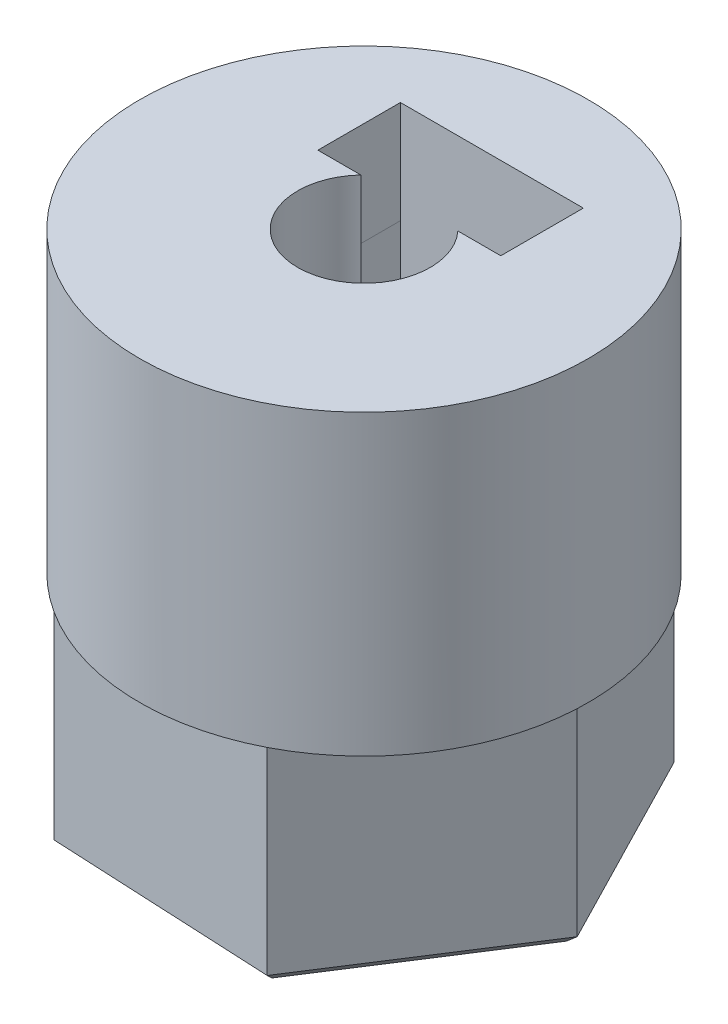
ISO-10303-21;
HEADER;
FILE_DESCRIPTION(('STEP AP214'),'2;1');
FILE_NAME('part.step','',(''),(''),'','','');
FILE_SCHEMA(('AUTOMOTIVE_DESIGN { 1 0 10303 214 1 1 1 1 }'));
ENDSEC;
DATA;
#1=APPLICATION_CONTEXT('core data for automotive mechanical design processes');
#2=APPLICATION_PROTOCOL_DEFINITION('international standard','automotive_design',2000,#1);
#3=PRODUCT_CONTEXT('',#1,'mechanical');
#4=PRODUCT('Part','Part','',(#3));
#5=PRODUCT_RELATED_PRODUCT_CATEGORY('part','',(#4));
#6=PRODUCT_DEFINITION_FORMATION('','',#4);
#7=PRODUCT_DEFINITION_CONTEXT('part definition',#1,'design');
#8=PRODUCT_DEFINITION('design','',#6,#7);
#9=PRODUCT_DEFINITION_SHAPE('','',#8);
#10=(LENGTH_UNIT() NAMED_UNIT(*) SI_UNIT(.MILLI.,.METRE.));
#11=(NAMED_UNIT(*) PLANE_ANGLE_UNIT() SI_UNIT($,.RADIAN.));
#12=(NAMED_UNIT(*) SI_UNIT($,.STERADIAN.) SOLID_ANGLE_UNIT());
#13=UNCERTAINTY_MEASURE_WITH_UNIT(LENGTH_MEASURE(1.E-05),#10,'distance_accuracy_value','');
#14=(GEOMETRIC_REPRESENTATION_CONTEXT(3) GLOBAL_UNCERTAINTY_ASSIGNED_CONTEXT((#13)) GLOBAL_UNIT_ASSIGNED_CONTEXT((#10,
#11,#12)) REPRESENTATION_CONTEXT('',''));
#15=CARTESIAN_POINT('',(0.,0.,0.));
#16=DIRECTION('',(0.,0.,1.));
#17=DIRECTION('',(1.,0.,0.));
#18=AXIS2_PLACEMENT_3D('',#15,#16,#17);
#19=CARTESIAN_POINT('',(0.,0.,0.));
#20=DIRECTION('',(0.,1.,0.));
#21=DIRECTION('',(0.,0.,1.));
#22=AXIS2_PLACEMENT_3D('',#19,#20,#21);
#23=CYLINDRICAL_SURFACE('',#22,1.65);
#24=CARTESIAN_POINT('',(0.,0.300000000000004,0.));
#25=DIRECTION('',(0.,1.,0.));
#26=DIRECTION('',(0.,0.,1.));
#27=AXIS2_PLACEMENT_3D('',#24,#25,#26);
#28=CIRCLE('',#27,1.65);
#29=CARTESIAN_POINT('',(0.,0.300000000000004,1.65));
#30=VERTEX_POINT('',#29);
#31=EDGE_CURVE('E11',#30,#30,#28,.F.);
#32=ORIENTED_EDGE('',*,*,#31,.T.);
#33=EDGE_LOOP('',(#32));
#34=FACE_BOUND('',#33,.T.);
#35=CARTESIAN_POINT('',(0.,6.2,0.));
#36=DIRECTION('',(0.,1.,0.));
#37=DIRECTION('',(0.,0.,1.));
#38=AXIS2_PLACEMENT_3D('',#35,#36,#37);
#39=CIRCLE('',#38,1.65);
#40=CARTESIAN_POINT('',(0.,6.2,1.65));
#41=VERTEX_POINT('',#40);
#42=EDGE_CURVE('E188',#41,#41,#39,.T.);
#43=ORIENTED_EDGE('',*,*,#42,.T.);
#44=EDGE_LOOP('',(#43));
#45=FACE_BOUND('',#44,.T.);
#46=ADVANCED_FACE('F36',(#34,#45),#23,.F.);
#47=CARTESIAN_POINT('',(2.825,9.2,-1.4));
#48=DIRECTION('',(1.,0.,0.));
#49=DIRECTION('',(0.,0.,-1.));
#50=AXIS2_PLACEMENT_3D('',#47,#48,#49);
#51=PLANE('',#50);
#52=DIRECTION('',(0.,0.,-1.));
#53=VECTOR('',#52,1.);
#54=CARTESIAN_POINT('',(2.825,12.4310285797245,-1.4));
#55=LINE('',#54,#53);
#56=CARTESIAN_POINT('',(2.825,12.4310285797245,-1.4));
#57=VERTEX_POINT('',#56);
#58=CARTESIAN_POINT('',(2.825,12.4310285797245,-3.95));
#59=VERTEX_POINT('',#58);
#60=EDGE_CURVE('E705',#57,#59,#55,.T.);
#61=ORIENTED_EDGE('',*,*,#60,.F.);
#62=DIRECTION('',(0.,1.,0.));
#63=VECTOR('',#62,1.);
#64=CARTESIAN_POINT('',(2.825,9.2,-1.4));
#65=LINE('',#64,#63);
#66=CARTESIAN_POINT('',(2.825,15.6,-1.4));
#67=VERTEX_POINT('',#66);
#68=EDGE_CURVE('E216',#57,#67,#65,.T.);
#69=ORIENTED_EDGE('',*,*,#68,.T.);
#70=DIRECTION('',(0.,0.,-1.));
#71=VECTOR('',#70,1.);
#72=CARTESIAN_POINT('',(2.825,15.6,-1.4));
#73=LINE('',#72,#71);
#74=CARTESIAN_POINT('',(2.825,15.6,-3.95));
#75=VERTEX_POINT('',#74);
#76=EDGE_CURVE('E206',#67,#75,#73,.T.);
#77=ORIENTED_EDGE('',*,*,#76,.T.);
#78=DIRECTION('',(0.,1.,0.));
#79=VECTOR('',#78,1.);
#80=CARTESIAN_POINT('',(2.825,9.2,-3.95));
#81=LINE('',#80,#79);
#82=EDGE_CURVE('E210',#59,#75,#81,.T.);
#83=ORIENTED_EDGE('',*,*,#82,.F.);
#84=EDGE_LOOP('',(#61,#69,#77,#83));
#85=FACE_BOUND('',#84,.T.);
#86=ADVANCED_FACE('F289',(#85),#51,.F.);
#87=CARTESIAN_POINT('',(-2.825,9.2,-1.4));
#88=DIRECTION('',(-1.,0.,0.));
#89=DIRECTION('',(0.,0.,1.));
#90=AXIS2_PLACEMENT_3D('',#87,#88,#89);
#91=PLANE('',#90);
#92=DIRECTION('',(0.,0.,-1.));
#93=VECTOR('',#92,1.);
#94=CARTESIAN_POINT('',(-2.82500000000001,12.4377890471123,-1.4));
#95=LINE('',#94,#93);
#96=CARTESIAN_POINT('',(-2.82500000000001,12.4377890471123,-1.4));
#97=VERTEX_POINT('',#96);
#98=CARTESIAN_POINT('',(-2.82500000000001,12.4377890471123,-3.95));
#99=VERTEX_POINT('',#98);
#100=EDGE_CURVE('E704',#97,#99,#95,.T.);
#101=ORIENTED_EDGE('',*,*,#100,.T.);
#102=DIRECTION('',(0.,1.,0.));
#103=VECTOR('',#102,1.);
#104=CARTESIAN_POINT('',(-2.825,9.2,-3.95));
#105=LINE('',#104,#103);
#106=CARTESIAN_POINT('',(-2.825,15.6,-3.95));
#107=VERTEX_POINT('',#106);
#108=EDGE_CURVE('E221',#99,#107,#105,.T.);
#109=ORIENTED_EDGE('',*,*,#108,.T.);
#110=DIRECTION('',(0.,0.,1.));
#111=VECTOR('',#110,1.);
#112=CARTESIAN_POINT('',(-2.825,15.6,-1.4));
#113=LINE('',#112,#111);
#114=CARTESIAN_POINT('',(-2.825,15.6,-1.4));
#115=VERTEX_POINT('',#114);
#116=EDGE_CURVE('E208',#107,#115,#113,.T.);
#117=ORIENTED_EDGE('',*,*,#116,.T.);
#118=DIRECTION('',(0.,1.,0.));
#119=VECTOR('',#118,1.);
#120=CARTESIAN_POINT('',(-2.825,9.2,-1.4));
#121=LINE('',#120,#119);
#122=EDGE_CURVE('E219',#97,#115,#121,.T.);
#123=ORIENTED_EDGE('',*,*,#122,.F.);
#124=EDGE_LOOP('',(#101,#109,#117,#123));
#125=FACE_BOUND('',#124,.T.);
#126=ADVANCED_FACE('F282',(#125),#91,.F.);
#127=CARTESIAN_POINT('',(2.825,9.2,-1.4));
#128=DIRECTION('',(0.,0.,1.));
#129=DIRECTION('',(1.,0.,0.));
#130=AXIS2_PLACEMENT_3D('',#127,#128,#129);
#131=PLANE('',#130);
#132=DIRECTION('',(0.866922346485974,0.49844322160428,0.));
#133=VECTOR('',#132,1.);
#134=CARTESIAN_POINT('',(-0.00586692083917137,7.53458371075279,-1.4));
#135=LINE('',#134,#133);
#136=CARTESIAN_POINT('',(1.49749791318719,8.39895410581309,-1.4));
#137=VERTEX_POINT('',#136);
#138=CARTESIAN_POINT('',(2.82500000000001,9.16221095288768,-1.4));
#139=VERTEX_POINT('',#138);
#140=EDGE_CURVE('E734',#137,#139,#135,.T.);
#141=ORIENTED_EDGE('',*,*,#140,.F.);
#142=DIRECTION('',(0.,1.,0.));
#143=VECTOR('',#142,1.);
#144=CARTESIAN_POINT('',(1.49749791318719,6.2,-1.4));
#145=LINE('',#144,#143);
#146=CARTESIAN_POINT('',(1.49749791318719,10.7133974596216,-1.4));
#147=VERTEX_POINT('',#146);
#148=EDGE_CURVE('E669',#137,#147,#145,.T.);
#149=ORIENTED_EDGE('',*,*,#148,.T.);
#150=CARTESIAN_POINT('',(1.49749791318719,10.8866025403784,-1.4));
#151=CARTESIAN_POINT('',(1.49791495468869,10.8793915634154,-1.39955388894445));
#152=CARTESIAN_POINT('',(1.49828004462218,10.8721741531062,-1.399162999295));
#153=CARTESIAN_POINT('',(1.49890560063073,10.8577393216827,-1.39849284226909));
#154=CARTESIAN_POINT('',(1.49916620605117,10.8505219135061,-1.39821342622874));
#155=CARTESIAN_POINT('',(1.49958300339212,10.8360870840948,-1.3977663982465));
#156=CARTESIAN_POINT('',(1.49973928847832,10.8288696686438,-1.39759868654472));
#157=CARTESIAN_POINT('',(1.4999476101484,10.8144348344959,-1.39737510764477));
#158=CARTESIAN_POINT('',(1.49999969338726,10.807217417248,-1.39731919039213));
#159=CARTESIAN_POINT('',(1.49999969338726,10.792782582752,-1.39731919039213));
#160=CARTESIAN_POINT('',(1.4999476101484,10.7855651655041,-1.39737510764477));
#161=CARTESIAN_POINT('',(1.49973928847832,10.7711303313562,-1.39759868654472));
#162=CARTESIAN_POINT('',(1.49958300339212,10.7639129159052,-1.3977663982465));
#163=CARTESIAN_POINT('',(1.49916620605117,10.7494780864939,-1.39821342622874));
#164=CARTESIAN_POINT('',(1.49890560063073,10.7422606783173,-1.39849284226909));
#165=CARTESIAN_POINT('',(1.49828004462218,10.7278258468938,-1.399162999295));
#166=CARTESIAN_POINT('',(1.49791495468869,10.7206084365846,-1.39955388894445));
#167=CARTESIAN_POINT('',(1.49749791318719,10.7133974596216,-1.4));
#168=B_SPLINE_CURVE_WITH_KNOTS('',3,(#150,#151,#152,#153,#154,#155,#156,#157,#158,#159,#160,
#161,#162,#163,#164,#165,#166,#167),.UNSPECIFIED.,.F.,.F.,(4,2,2,2,2,2,2,2,4),(0.,
0.0217099880449863,0.0433909255597532,0.0650524744091502,0.0867043224148513,0.108356170420552,
0.130017719269949,0.151698656784716,0.173408644829703),.UNSPECIFIED.);
#169=CARTESIAN_POINT('',(1.49749791318719,10.8866025403784,-1.4));
#170=VERTEX_POINT('',#169);
#171=EDGE_CURVE('E197',#170,#147,#168,.T.);
#172=ORIENTED_EDGE('',*,*,#171,.F.);
#173=CARTESIAN_POINT('',(1.49749791318719,15.6,-1.4));
#174=VERTEX_POINT('',#173);
#175=EDGE_CURVE('E180',#170,#174,#145,.T.);
#176=ORIENTED_EDGE('',*,*,#175,.T.);
#177=DIRECTION('',(1.,0.,0.));
#178=VECTOR('',#177,1.);
#179=CARTESIAN_POINT('',(2.825,15.6,-1.4));
#180=LINE('',#179,#178);
#181=EDGE_CURVE('E194',#174,#67,#180,.T.);
#182=ORIENTED_EDGE('',*,*,#181,.T.);
#183=ORIENTED_EDGE('',*,*,#68,.F.);
#184=DIRECTION('',(-0.86512566549645,0.501555164363129,0.));
#185=VECTOR('',#184,1.);
#186=CARTESIAN_POINT('',(2.83086692083919,12.4276272421349,-1.4));
#187=LINE('',#186,#185);
#188=CARTESIAN_POINT('',(2.83086692083919,12.4276272421349,-1.4));
#189=VERTEX_POINT('',#188);
#190=EDGE_CURVE('E719',#189,#57,#187,.T.);
#191=ORIENTED_EDGE('',*,*,#190,.F.);
#192=DIRECTION('',(0.00179668098952422,0.999998385967408,0.));
#193=VECTOR('',#192,1.);
#194=CARTESIAN_POINT('',(2.82500000000001,9.16221095288768,-1.4));
#195=LINE('',#194,#193);
#196=EDGE_CURVE('E732',#139,#189,#195,.T.);
#197=ORIENTED_EDGE('',*,*,#196,.F.);
#198=EDGE_LOOP('',(#141,#149,#172,#176,#182,#183,#191,#197));
#199=FACE_BOUND('',#198,.T.);
#200=ADVANCED_FACE('F192',(#199),#131,.F.);
#201=CARTESIAN_POINT('',(-3.74949151101248,6.4,5.82591738774638));
#202=DIRECTION('',(0.0482370673650742,0.,-0.998835915119204));
#203=DIRECTION('',(-0.998835915119204,0.,-0.0482370673650743));
#204=AXIS2_PLACEMENT_3D('',#201,#202,#203);
#205=PLANE('',#204);
#206=DIRECTION('',(0.,-1.,0.));
#207=VECTOR('',#206,1.);
#208=CARTESIAN_POINT('',(-3.74949151101248,6.4,5.82591738774638));
#209=LINE('',#208,#207);
#210=CARTESIAN_POINT('',(-3.74949151101247,6.4,5.82591738774638));
#211=VERTEX_POINT('',#210);
#212=CARTESIAN_POINT('',(-3.74949151101248,0.299999999999998,5.82591738774638));
#213=VERTEX_POINT('',#212);
#214=EDGE_CURVE('E249',#211,#213,#209,.T.);
#215=ORIENTED_EDGE('',*,*,#214,.T.);
#216=DIRECTION('',(0.998835915119204,0.,0.0482370673650743));
#217=VECTOR('',#216,1.);
#218=CARTESIAN_POINT('',(-3.74949151101248,0.299999999999998,5.82591738774638));
#219=LINE('',#218,#217);
#220=CARTESIAN_POINT('',(3.1706467026316,0.299999999999998,6.16011359368411));
#221=VERTEX_POINT('',#220);
#222=EDGE_CURVE('E46',#213,#221,#219,.T.);
#223=ORIENTED_EDGE('',*,*,#222,.T.);
#224=DIRECTION('',(0.,-1.,0.));
#225=VECTOR('',#224,1.);
#226=CARTESIAN_POINT('',(3.1706467026316,6.4,6.16011359368411));
#227=LINE('',#226,#225);
#228=CARTESIAN_POINT('',(3.1706467026316,6.4,6.16011359368411));
#229=VERTEX_POINT('',#228);
#230=EDGE_CURVE('E261',#229,#221,#227,.T.);
#231=ORIENTED_EDGE('',*,*,#230,.F.);
#232=DIRECTION('',(0.998835915119204,0.,0.0482370673650742));
#233=VECTOR('',#232,1.);
#234=CARTESIAN_POINT('',(-3.74949151101248,6.4,5.82591738774638));
#235=LINE('',#234,#233);
#236=EDGE_CURVE('E227',#211,#229,#235,.T.);
#237=ORIENTED_EDGE('',*,*,#236,.F.);
#238=EDGE_LOOP('',(#215,#223,#231,#237));
#239=FACE_BOUND('',#238,.T.);
#240=ADVANCED_FACE('F281',(#239),#205,.F.);
#241=CARTESIAN_POINT('',(3.1706467026316,6.4,6.16011359368411));
#242=DIRECTION('',(-0.840898743022971,0.,-0.541192483301817));
#243=DIRECTION('',(-0.541192483301817,0.,0.840898743022971));
#244=AXIS2_PLACEMENT_3D('',#241,#242,#243);
#245=PLANE('',#244);
#246=ORIENTED_EDGE('',*,*,#230,.T.);
#247=DIRECTION('',(0.541192483301817,0.,-0.840898743022971));
#248=VECTOR('',#247,1.);
#249=CARTESIAN_POINT('',(3.1706467026316,0.299999999999998,6.16011359368411));
#250=LINE('',#249,#248);
#251=CARTESIAN_POINT('',(6.92013821364408,0.299999999999997,0.334196205937727));
#252=VERTEX_POINT('',#251);
#253=EDGE_CURVE('E265',#221,#252,#250,.T.);
#254=ORIENTED_EDGE('',*,*,#253,.T.);
#255=DIRECTION('',(0.,-1.,0.));
#256=VECTOR('',#255,1.);
#257=CARTESIAN_POINT('',(6.92013821364408,6.4,0.334196205937727));
#258=LINE('',#257,#256);
#259=CARTESIAN_POINT('',(6.92013821364408,6.4,0.334196205937727));
#260=VERTEX_POINT('',#259);
#261=EDGE_CURVE('E258',#260,#252,#258,.T.);
#262=ORIENTED_EDGE('',*,*,#261,.F.);
#263=DIRECTION('',(0.541192483301817,0.,-0.840898743022971));
#264=VECTOR('',#263,1.);
#265=CARTESIAN_POINT('',(3.1706467026316,6.4,6.16011359368411));
#266=LINE('',#265,#264);
#267=EDGE_CURVE('E234',#229,#260,#266,.T.);
#268=ORIENTED_EDGE('',*,*,#267,.F.);
#269=EDGE_LOOP('',(#246,#254,#262,#268));
#270=FACE_BOUND('',#269,.T.);
#271=ADVANCED_FACE('F330',(#270),#245,.F.);
#272=CARTESIAN_POINT('',(6.92013821364408,6.4,0.334196205937727));
#273=DIRECTION('',(-0.889135810388045,0.,0.457643431817386));
#274=DIRECTION('',(0.457643431817386,0.,0.889135810388045));
#275=AXIS2_PLACEMENT_3D('',#272,#273,#274);
#276=PLANE('',#275);
#277=ORIENTED_EDGE('',*,*,#261,.T.);
#278=DIRECTION('',(-0.457643431817386,0.,-0.889135810388045));
#279=VECTOR('',#278,1.);
#280=CARTESIAN_POINT('',(6.92013821364408,0.299999999999997,0.334196205937727));
#281=LINE('',#280,#279);
#282=CARTESIAN_POINT('',(3.74949151101249,0.299999999999998,-5.82591738774638));
#283=VERTEX_POINT('',#282);
#284=EDGE_CURVE('E409',#252,#283,#281,.T.);
#285=ORIENTED_EDGE('',*,*,#284,.T.);
#286=DIRECTION('',(0.,-1.,0.));
#287=VECTOR('',#286,1.);
#288=CARTESIAN_POINT('',(3.74949151101249,6.4,-5.82591738774638));
#289=LINE('',#288,#287);
#290=CARTESIAN_POINT('',(3.74949151101249,6.4,-5.82591738774638));
#291=VERTEX_POINT('',#290);
#292=EDGE_CURVE('E255',#291,#283,#289,.T.);
#293=ORIENTED_EDGE('',*,*,#292,.F.);
#294=DIRECTION('',(-0.457643431817386,0.,-0.889135810388045));
#295=VECTOR('',#294,1.);
#296=CARTESIAN_POINT('',(6.92013821364408,6.4,0.334196205937727));
#297=LINE('',#296,#295);
#298=EDGE_CURVE('E237',#260,#291,#297,.T.);
#299=ORIENTED_EDGE('',*,*,#298,.F.);
#300=EDGE_LOOP('',(#277,#285,#293,#299));
#301=FACE_BOUND('',#300,.T.);
#302=ADVANCED_FACE('F326',(#301),#276,.F.);
#303=CARTESIAN_POINT('',(3.74949151101249,6.4,-5.82591738774638));
#304=DIRECTION('',(-0.048237067365074,0.,0.998835915119204));
#305=DIRECTION('',(0.998835915119204,0.,0.048237067365074));
#306=AXIS2_PLACEMENT_3D('',#303,#304,#305);
#307=PLANE('',#306);
#308=ORIENTED_EDGE('',*,*,#292,.T.);
#309=DIRECTION('',(-0.998835915119204,0.,-0.048237067365074));
#310=VECTOR('',#309,1.);
#311=CARTESIAN_POINT('',(3.74949151101249,0.299999999999998,-5.82591738774638));
#312=LINE('',#311,#310);
#313=CARTESIAN_POINT('',(-3.17064670263159,0.299999999999999,-6.1601135936841));
#314=VERTEX_POINT('',#313);
#315=EDGE_CURVE('E411',#283,#314,#312,.T.);
#316=ORIENTED_EDGE('',*,*,#315,.T.);
#317=DIRECTION('',(0.,-1.,0.));
#318=VECTOR('',#317,1.);
#319=CARTESIAN_POINT('',(-3.17064670263159,6.4,-6.1601135936841));
#320=LINE('',#319,#318);
#321=CARTESIAN_POINT('',(-3.17064670263159,6.4,-6.1601135936841));
#322=VERTEX_POINT('',#321);
#323=EDGE_CURVE('E253',#322,#314,#320,.T.);
#324=ORIENTED_EDGE('',*,*,#323,.F.);
#325=DIRECTION('',(-0.998835915119204,0.,-0.048237067365074));
#326=VECTOR('',#325,1.);
#327=CARTESIAN_POINT('',(3.74949151101249,6.4,-5.82591738774638));
#328=LINE('',#327,#326);
#329=EDGE_CURVE('E240',#291,#322,#328,.T.);
#330=ORIENTED_EDGE('',*,*,#329,.F.);
#331=EDGE_LOOP('',(#308,#316,#324,#330));
#332=FACE_BOUND('',#331,.T.);
#333=ADVANCED_FACE('F323',(#332),#307,.F.);
#334=CARTESIAN_POINT('',(-3.17064670263159,6.4,-6.1601135936841));
#335=DIRECTION('',(0.840898743022971,0.,0.541192483301817));
#336=DIRECTION('',(0.541192483301817,0.,-0.840898743022971));
#337=AXIS2_PLACEMENT_3D('',#334,#335,#336);
#338=PLANE('',#337);
#339=ORIENTED_EDGE('',*,*,#323,.T.);
#340=DIRECTION('',(-0.541192483301817,0.,0.840898743022971));
#341=VECTOR('',#340,1.);
#342=CARTESIAN_POINT('',(-3.17064670263159,0.299999999999999,-6.1601135936841));
#343=LINE('',#342,#341);
#344=CARTESIAN_POINT('',(-6.92013821364407,0.299999999999998,-0.334196205937717));
#345=VERTEX_POINT('',#344);
#346=EDGE_CURVE('E62',#314,#345,#343,.T.);
#347=ORIENTED_EDGE('',*,*,#346,.T.);
#348=DIRECTION('',(0.,-1.,0.));
#349=VECTOR('',#348,1.);
#350=CARTESIAN_POINT('',(-6.92013821364407,6.4,-0.334196205937717));
#351=LINE('',#350,#349);
#352=CARTESIAN_POINT('',(-6.92013821364407,6.4,-0.334196205937717));
#353=VERTEX_POINT('',#352);
#354=EDGE_CURVE('E251',#353,#345,#351,.T.);
#355=ORIENTED_EDGE('',*,*,#354,.F.);
#356=DIRECTION('',(-0.541192483301817,0.,0.840898743022971));
#357=VECTOR('',#356,1.);
#358=CARTESIAN_POINT('',(-3.17064670263159,6.4,-6.1601135936841));
#359=LINE('',#358,#357);
#360=EDGE_CURVE('E243',#322,#353,#359,.T.);
#361=ORIENTED_EDGE('',*,*,#360,.F.);
#362=EDGE_LOOP('',(#339,#347,#355,#361));
#363=FACE_BOUND('',#362,.T.);
#364=ADVANCED_FACE('F320',(#363),#338,.F.);
#365=CARTESIAN_POINT('',(-6.92013821364407,6.4,-0.334196205937717));
#366=DIRECTION('',(0.889135810388045,0.,-0.457643431817387));
#367=DIRECTION('',(-0.457643431817387,0.,-0.889135810388045));
#368=AXIS2_PLACEMENT_3D('',#365,#366,#367);
#369=PLANE('',#368);
#370=ORIENTED_EDGE('',*,*,#354,.T.);
#371=DIRECTION('',(0.457643431817387,0.,0.889135810388045));
#372=VECTOR('',#371,1.);
#373=CARTESIAN_POINT('',(-6.92013821364407,0.299999999999998,-0.334196205937717));
#374=LINE('',#373,#372);
#375=EDGE_CURVE('E54',#345,#213,#374,.T.);
#376=ORIENTED_EDGE('',*,*,#375,.T.);
#377=ORIENTED_EDGE('',*,*,#214,.F.);
#378=DIRECTION('',(0.457643431817387,0.,0.889135810388044));
#379=VECTOR('',#378,1.);
#380=CARTESIAN_POINT('',(-6.92013821364407,6.4,-0.334196205937717));
#381=LINE('',#380,#379);
#382=EDGE_CURVE('E246',#353,#211,#381,.T.);
#383=ORIENTED_EDGE('',*,*,#382,.F.);
#384=EDGE_LOOP('',(#370,#376,#377,#383));
#385=FACE_BOUND('',#384,.T.);
#386=ADVANCED_FACE('F316',(#385),#369,.F.);
#387=CARTESIAN_POINT('',(0.,0.,0.));
#388=DIRECTION('',(0.,1.,0.));
#389=DIRECTION('',(0.,0.,1.));
#390=AXIS2_PLACEMENT_3D('',#387,#388,#389);
#391=PLANE('',#390);
#392=DIRECTION('',(0.457643431817386,0.,0.889135810388045));
#393=VECTOR('',#392,1.);
#394=CARTESIAN_POINT('',(5.06807411921187,0.,-2.60856756135911));
#395=LINE('',#394,#393);
#396=CARTESIAN_POINT('',(3.56201693546186,0.,-5.53462151835906));
#397=VERTEX_POINT('',#396);
#398=CARTESIAN_POINT('',(6.57413130296188,0.,0.317486395640841));
#399=VERTEX_POINT('',#398);
#400=EDGE_CURVE('E399',#397,#399,#395,.T.);
#401=ORIENTED_EDGE('',*,*,#400,.T.);
#402=DIRECTION('',(-0.541192483301817,0.,0.840898743022971));
#403=VECTOR('',#402,1.);
#404=CARTESIAN_POINT('',(4.79312283523095,0.,3.08479715482037));
#405=LINE('',#404,#403);
#406=CARTESIAN_POINT('',(3.01211436750002,0.,5.8521079139999));
#407=VERTEX_POINT('',#406);
#408=EDGE_CURVE('E401',#399,#407,#405,.T.);
#409=ORIENTED_EDGE('',*,*,#408,.T.);
#410=DIRECTION('',(-0.998835915119204,0.,-0.0482370673650743));
#411=VECTOR('',#410,1.);
#412=CARTESIAN_POINT('',(-0.274951283980924,0.,5.69336471617948));
#413=LINE('',#412,#411);
#414=CARTESIAN_POINT('',(-3.56201693546185,0.,5.53462151835906));
#415=VERTEX_POINT('',#414);
#416=EDGE_CURVE('E426',#407,#415,#413,.T.);
#417=ORIENTED_EDGE('',*,*,#416,.T.);
#418=DIRECTION('',(-0.457643431817387,0.,-0.889135810388045));
#419=VECTOR('',#418,1.);
#420=CARTESIAN_POINT('',(-5.06807411921186,0.,2.60856756135911));
#421=LINE('',#420,#419);
#422=CARTESIAN_POINT('',(-6.57413130296187,0.,-0.317486395640833));
#423=VERTEX_POINT('',#422);
#424=EDGE_CURVE('E403',#415,#423,#421,.T.);
#425=ORIENTED_EDGE('',*,*,#424,.T.);
#426=DIRECTION('',(0.541192483301817,0.,-0.840898743022971));
#427=VECTOR('',#426,1.);
#428=CARTESIAN_POINT('',(-4.79312283523094,0.,-3.08479715482036));
#429=LINE('',#428,#427);
#430=CARTESIAN_POINT('',(-3.01211436750001,0.,-5.8521079139999));
#431=VERTEX_POINT('',#430);
#432=EDGE_CURVE('E390',#423,#431,#429,.T.);
#433=ORIENTED_EDGE('',*,*,#432,.T.);
#434=DIRECTION('',(0.998835915119204,0.,0.048237067365074));
#435=VECTOR('',#434,1.);
#436=CARTESIAN_POINT('',(0.274951283980923,0.,-5.69336471617948));
#437=LINE('',#436,#435);
#438=EDGE_CURVE('E395',#431,#397,#437,.T.);
#439=ORIENTED_EDGE('',*,*,#438,.T.);
#440=EDGE_LOOP('',(#401,#409,#417,#425,#433,#439));
#441=FACE_BOUND('',#440,.T.);
#442=CARTESIAN_POINT('',(0.,0.,0.));
#443=DIRECTION('',(0.,1.,0.));
#444=DIRECTION('',(0.,0.,1.));
#445=AXIS2_PLACEMENT_3D('',#442,#443,#444);
#446=CIRCLE('',#445,1.95000000000001);
#447=CARTESIAN_POINT('',(0.,0.,1.95000000000001));
#448=VERTEX_POINT('',#447);
#449=EDGE_CURVE('E428',#448,#448,#446,.T.);
#450=ORIENTED_EDGE('',*,*,#449,.T.);
#451=EDGE_LOOP('',(#450));
#452=FACE_BOUND('',#451,.T.);
#453=ADVANCED_FACE('F313',(#441,#452),#391,.F.);
#454=CARTESIAN_POINT('',(0.,6.4,0.));
#455=DIRECTION('',(0.,1.,0.));
#456=DIRECTION('',(0.,0.,1.));
#457=AXIS2_PLACEMENT_3D('',#454,#455,#456);
#458=PLANE('',#457);
#459=CARTESIAN_POINT('',(0.,6.4,0.));
#460=DIRECTION('',(0.,1.,0.));
#461=DIRECTION('',(0.,0.,1.));
#462=AXIS2_PLACEMENT_3D('',#459,#460,#461);
#463=CIRCLE('',#462,6.92820323027553);
#464=EDGE_CURVE('E218',#211,#229,#463,.T.);
#465=ORIENTED_EDGE('',*,*,#464,.F.);
#466=ORIENTED_EDGE('',*,*,#236,.T.);
#467=EDGE_LOOP('',(#465,#466));
#468=FACE_BOUND('',#467,.T.);
#469=ADVANCED_FACE('F308',(#468),#458,.F.);
#470=EDGE_CURVE('E228',#229,#260,#463,.T.);
#471=ORIENTED_EDGE('',*,*,#470,.F.);
#472=ORIENTED_EDGE('',*,*,#267,.T.);
#473=EDGE_LOOP('',(#471,#472));
#474=FACE_BOUND('',#473,.T.);
#475=ADVANCED_FACE('F444',(#474),#458,.F.);
#476=EDGE_CURVE('E231',#260,#291,#463,.T.);
#477=ORIENTED_EDGE('',*,*,#476,.F.);
#478=ORIENTED_EDGE('',*,*,#298,.T.);
#479=EDGE_LOOP('',(#477,#478));
#480=FACE_BOUND('',#479,.T.);
#481=ADVANCED_FACE('F446',(#480),#458,.F.);
#482=EDGE_CURVE('E449',#291,#322,#463,.T.);
#483=ORIENTED_EDGE('',*,*,#482,.F.);
#484=ORIENTED_EDGE('',*,*,#329,.T.);
#485=EDGE_LOOP('',(#483,#484));
#486=FACE_BOUND('',#485,.T.);
#487=ADVANCED_FACE('F460',(#486),#458,.F.);
#488=EDGE_CURVE('E457',#322,#353,#463,.T.);
#489=ORIENTED_EDGE('',*,*,#488,.F.);
#490=ORIENTED_EDGE('',*,*,#360,.T.);
#491=EDGE_LOOP('',(#489,#490));
#492=FACE_BOUND('',#491,.T.);
#493=ADVANCED_FACE('F309',(#492),#458,.F.);
#494=CARTESIAN_POINT('',(0.,15.6,0.));
#495=DIRECTION('',(0.,-1.,0.));
#496=DIRECTION('',(0.,0.,-1.));
#497=AXIS2_PLACEMENT_3D('',#494,#495,#496);
#498=CYLINDRICAL_SURFACE('',#497,6.92820323027553);
#499=CARTESIAN_POINT('',(1.5,10.8,-6.76387462923436));
#500=CARTESIAN_POINT('',(1.49999711063024,10.7168107578905,-6.76387631007943));
#501=CARTESIAN_POINT('',(1.49305601710308,10.6335865878515,-6.76542606449834));
#502=CARTESIAN_POINT('',(1.46550453127225,10.4695034667374,-6.77144652376351));
#503=CARTESIAN_POINT('',(1.44488412706469,10.3886462933616,-6.77591936798701));
#504=CARTESIAN_POINT('',(1.39065246908658,10.2316944690861,-6.78725622713192));
#505=CARTESIAN_POINT('',(1.35705530481313,10.1555947565408,-6.79411764786521));
#506=CARTESIAN_POINT('',(1.27786394000764,10.0101107921088,-6.80945543330038));
#507=CARTESIAN_POINT('',(1.23227003812153,9.94072637311083,-6.81793175779951));
#508=CARTESIAN_POINT('',(1.12957492911764,9.80949260020851,-6.83570104539681));
#509=CARTESIAN_POINT('',(1.0723127318708,9.74777059515672,-6.84500427532109));
#510=CARTESIAN_POINT('',(0.948254067946201,9.63472860268302,-6.86328919283221));
#511=CARTESIAN_POINT('',(0.881456870077813,9.58340941373116,-6.8722708556936));
#512=CARTESIAN_POINT('',(0.739371794666825,9.49212724618599,-6.8890123261093));
#513=CARTESIAN_POINT('',(0.664003611158532,9.4522865736865,-6.89675860785291));
#514=CARTESIAN_POINT('',(0.507446296757908,9.38588339647681,-6.91004062718765));
#515=CARTESIAN_POINT('',(0.42625780675886,9.35931943238418,-6.91557660772273));
#516=CARTESIAN_POINT('',(0.261688356024988,9.32062375458321,-6.92374172028618));
#517=CARTESIAN_POINT('',(0.178360247426548,9.30827656767505,-6.92641420767853));
#518=CARTESIAN_POINT('',(0.0107753747929908,9.29769141566782,-6.92870137167427));
#519=CARTESIAN_POINT('',(-0.0734812840021718,9.29945186773188,-6.92831639131687));
#520=CARTESIAN_POINT('',(-0.239046697774533,9.31687117838683,-6.92456518764393));
#521=CARTESIAN_POINT('',(-0.320381180895609,9.33229780311083,-6.92124878111962));
#522=CARTESIAN_POINT('',(-0.479278844551764,9.37624169330321,-6.91206404859949));
#523=CARTESIAN_POINT('',(-0.556841856677825,9.40475954274676,-6.90619560876283));
#524=CARTESIAN_POINT('',(-0.706641717635534,9.47428297516565,-6.89248583667329));
#525=CARTESIAN_POINT('',(-0.778836219593034,9.51537694952757,-6.88463061037111));
#526=CARTESIAN_POINT('',(-0.915389450102991,9.60882027547906,-6.86780915076223));
#527=CARTESIAN_POINT('',(-0.979747129563682,9.66117113140466,-6.85884276903197));
#528=CARTESIAN_POINT('',(-1.10018068391264,9.77690771010537,-6.84056970252901));
#529=CARTESIAN_POINT('',(-1.15606091277459,9.84049668776135,-6.83125980682325));
#530=CARTESIAN_POINT('',(-1.25640027699556,9.97623916807671,-6.81352055093798));
#531=CARTESIAN_POINT('',(-1.30085911527942,10.0483928934374,-6.80509121366555));
#532=CARTESIAN_POINT('',(-1.37717820654269,10.1995286499102,-6.79005925103508));
#533=CARTESIAN_POINT('',(-1.40900213880256,10.2785295824033,-6.78346190809713));
#534=CARTESIAN_POINT('',(-1.45886403343271,10.4409344336936,-6.77291458543831));
#535=CARTESIAN_POINT('',(-1.47690413391242,10.5243376674717,-6.76896419514125));
#536=CARTESIAN_POINT('',(-1.49838416707158,10.6913936880666,-6.76424161590355));
#537=CARTESIAN_POINT('',(-1.50210868714974,10.7750081741616,-6.7634074865969));
#538=CARTESIAN_POINT('',(-1.495621746704,10.9416633564846,-6.76484488654192));
#539=CARTESIAN_POINT('',(-1.48541122269928,11.024704090895,-6.76711620708861));
#540=CARTESIAN_POINT('',(-1.45159075885134,11.1868678560749,-6.77445015448319));
#541=CARTESIAN_POINT('',(-1.4281369882697,11.2660250649163,-6.77948022958784));
#542=CARTESIAN_POINT('',(-1.36866463172249,11.4192862723141,-6.79173565941537));
#543=CARTESIAN_POINT('',(-1.33264486316994,11.4933897944828,-6.79896122074736));
#544=CARTESIAN_POINT('',(-1.24843387568722,11.6356733455878,-6.81492994785407));
#545=CARTESIAN_POINT('',(-1.20006700644468,11.7037469787324,-6.82369439066362));
#546=CARTESIAN_POINT('',(-1.09276513755661,11.830915978947,-6.84169695975429));
#547=CARTESIAN_POINT('',(-1.03382885332575,11.8900102530693,-6.85093514351536));
#548=CARTESIAN_POINT('',(-0.905774585281072,11.9986445375065,-6.86904807690617));
#549=CARTESIAN_POINT('',(-0.836490564960972,12.0479907191857,-6.87791313005617));
#550=CARTESIAN_POINT('',(-0.690451068416318,12.1343433506771,-6.89410376112099));
#551=CARTESIAN_POINT('',(-0.613695937480646,12.1713503704132,-6.90142941013237));
#552=CARTESIAN_POINT('',(-0.455366177729,12.2317026969904,-6.91367487915002));
#553=CARTESIAN_POINT('',(-0.373825365545701,12.2551335317398,-6.91860972781112));
#554=CARTESIAN_POINT('',(-0.207846225203227,12.2879359817381,-6.92558248997333));
#555=CARTESIAN_POINT('',(-0.123408311049983,12.2973095973236,-6.92762081564632));
#556=CARTESIAN_POINT('',(0.0441267311672742,12.3016431118819,-6.92855893554458));
#557=CARTESIAN_POINT('',(0.127216146938087,12.2968926465629,-6.92752179797074));
#558=CARTESIAN_POINT('',(0.291382436320014,12.2737596767667,-6.92256033991983));
#559=CARTESIAN_POINT('',(0.372459344670476,12.2553774077673,-6.91863606931552));
#560=CARTESIAN_POINT('',(0.530080451916065,12.2056402385779,-6.90834559477079));
#561=CARTESIAN_POINT('',(0.606637899170262,12.1743256526271,-6.90198698391713));
#562=CARTESIAN_POINT('',(0.753450912661376,12.0996523622908,-6.88750751106167));
#563=CARTESIAN_POINT('',(0.823705879759745,12.0562925144372,-6.87938648176783));
#564=CARTESIAN_POINT('',(0.95733485851971,11.9578110946747,-6.86207980300835));
#565=CARTESIAN_POINT('',(1.02055624722805,11.9024854009786,-6.85287713453018));
#566=CARTESIAN_POINT('',(1.13691665406785,11.7820554790651,-6.834537182438));
#567=CARTESIAN_POINT('',(1.19005324444603,11.7169489029985,-6.8253999150764));
#568=CARTESIAN_POINT('',(1.285402255663,11.5777844914155,-6.80809269084834));
#569=CARTESIAN_POINT('',(1.32746317290399,11.5036209922881,-6.79993690309086));
#570=CARTESIAN_POINT('',(1.39845776088361,11.3491180387956,-6.78569356050037));
#571=CARTESIAN_POINT('',(1.42740264085434,11.2687839269011,-6.77960424074372));
#572=CARTESIAN_POINT('',(1.46612074818733,11.1236292844675,-6.77132024015675));
#573=CARTESIAN_POINT('',(1.47880130755343,11.0596014113304,-6.76854651383288));
#574=CARTESIAN_POINT('',(1.49574186882899,10.9303894755844,-6.76482309230541));
#575=CARTESIAN_POINT('',(1.50000226474843,10.8652054672193,-6.76387331175285));
#576=CARTESIAN_POINT('',(1.5,10.8,-6.76387462923436));
#577=B_SPLINE_CURVE_WITH_KNOTS('',3,(#499,#500,#501,#502,#503,#504,#505,#506,#507,#508,#509,
#510,#511,#512,#513,#514,#515,#516,#517,#518,#519,#520,#521,#522,#523,#524,#525,#526,#527,#528,
#529,#530,#531,#532,#533,#534,#535,#536,#537,#538,#539,#540,#541,#542,#543,#544,#545,#546,#547,
#548,#549,#550,#551,#552,#553,#554,#555,#556,#557,#558,#559,#560,#561,#562,#563,#564,#565,#566,
#567,#568,#569,#570,#571,#572,#573,#574,#575,#576),.UNSPECIFIED.,.T.,.F.,(4,2,2,2,2,2,2,2,2,2,2,
2,2,2,2,2,2,2,2,2,2,2,2,2,2,2,2,2,2,2,2,2,2,2,2,2,2,2,4),(0.,0.249328781486339,
0.498840248635306,0.748081567187708,0.997316681731106,1.25025689329135,1.50321651197878,
1.75877942758207,2.01431424540033,2.26592290250882,2.51750333023894,2.76488886280869,
3.01228543185917,3.26146239729535,3.51067268271452,3.76496489575674,4.01926372237652,
4.27428836188709,4.52927343465333,4.77916247888929,5.02903472989831,5.27602015193824,
5.52302882406718,5.77376898255453,6.02453963617227,6.27988216938055,6.53521290713862,
6.78891710239486,7.04258519222048,7.29108754979388,7.53958561480102,7.78731480879651,
8.0350675280025,8.28743710301911,8.53986735511033,8.79558964621276,9.05109297775108,
9.24653123492711,9.441960346622),.UNSPECIFIED.);
#578=CARTESIAN_POINT('',(1.5,10.8,-6.76387462923436));
#579=VERTEX_POINT('',#578);
#580=EDGE_CURVE('E686',#579,#579,#577,.T.);
#581=ORIENTED_EDGE('',*,*,#580,.F.);
#582=EDGE_LOOP('',(#581));
#583=FACE_BOUND('',#582,.T.);
#584=CARTESIAN_POINT('',(0.,15.6,0.));
#585=DIRECTION('',(0.,1.,0.));
#586=DIRECTION('',(0.,0.,1.));
#587=AXIS2_PLACEMENT_3D('',#584,#585,#586);
#588=CIRCLE('',#587,6.92820323027553);
#589=CARTESIAN_POINT('',(0.,15.6,6.92820323027553));
#590=VERTEX_POINT('',#589);
#591=EDGE_CURVE('E224',#590,#590,#588,.T.);
#592=ORIENTED_EDGE('',*,*,#591,.F.);
#593=EDGE_LOOP('',(#592));
#594=FACE_BOUND('',#593,.T.);
#595=ORIENTED_EDGE('',*,*,#470,.T.);
#596=ORIENTED_EDGE('',*,*,#476,.T.);
#597=ORIENTED_EDGE('',*,*,#482,.T.);
#598=ORIENTED_EDGE('',*,*,#488,.T.);
#599=EDGE_CURVE('E455',#353,#211,#463,.T.);
#600=ORIENTED_EDGE('',*,*,#599,.T.);
#601=ORIENTED_EDGE('',*,*,#464,.T.);
#602=EDGE_LOOP('',(#595,#596,#597,#598,#600,#601));
#603=FACE_BOUND('',#602,.T.);
#604=ADVANCED_FACE('F304',(#583,#594,#603),#498,.T.);
#605=CARTESIAN_POINT('',(0.,15.6,0.));
#606=DIRECTION('',(0.,1.,0.));
#607=DIRECTION('',(0.,0.,1.));
#608=AXIS2_PLACEMENT_3D('',#605,#606,#607);
#609=PLANE('',#608);
#610=CARTESIAN_POINT('',(0.,15.6,0.));
#611=DIRECTION('',(0.,1.,0.));
#612=DIRECTION('',(0.,0.,1.));
#613=AXIS2_PLACEMENT_3D('',#610,#611,#612);
#614=CIRCLE('',#613,2.05);
#615=CARTESIAN_POINT('',(-1.49749791318719,15.6,-1.4));
#616=VERTEX_POINT('',#615);
#617=EDGE_CURVE('E177',#616,#174,#614,.T.);
#618=ORIENTED_EDGE('',*,*,#617,.F.);
#619=EDGE_CURVE('E207',#115,#616,#180,.T.);
#620=ORIENTED_EDGE('',*,*,#619,.F.);
#621=ORIENTED_EDGE('',*,*,#116,.F.);
#622=DIRECTION('',(-1.,0.,0.));
#623=VECTOR('',#622,1.);
#624=CARTESIAN_POINT('',(2.825,15.6,-3.95));
#625=LINE('',#624,#623);
#626=EDGE_CURVE('E212',#75,#107,#625,.T.);
#627=ORIENTED_EDGE('',*,*,#626,.F.);
#628=ORIENTED_EDGE('',*,*,#76,.F.);
#629=ORIENTED_EDGE('',*,*,#181,.F.);
#630=EDGE_LOOP('',(#618,#620,#621,#627,#628,#629));
#631=FACE_BOUND('',#630,.T.);
#632=ORIENTED_EDGE('',*,*,#591,.T.);
#633=EDGE_LOOP('',(#632));
#634=FACE_BOUND('',#633,.T.);
#635=ADVANCED_FACE('F202',(#631,#634),#609,.T.);
#636=ORIENTED_EDGE('',*,*,#599,.F.);
#637=ORIENTED_EDGE('',*,*,#382,.T.);
#638=EDGE_LOOP('',(#636,#637));
#639=FACE_BOUND('',#638,.T.);
#640=ADVANCED_FACE('F303',(#639),#458,.F.);
#641=ORIENTED_EDGE('',*,*,#619,.T.);
#642=DIRECTION('',(0.,1.,0.));
#643=VECTOR('',#642,1.);
#644=CARTESIAN_POINT('',(-1.49749791318719,6.2,-1.4));
#645=LINE('',#644,#643);
#646=CARTESIAN_POINT('',(-1.4974979131872,8.39935429539026,-1.4));
#647=VERTEX_POINT('',#646);
#648=EDGE_CURVE('E183',#616,#647,#645,.F.);
#649=ORIENTED_EDGE('',*,*,#648,.T.);
#650=DIRECTION('',(0.86512566549645,-0.501555164363128,0.));
#651=VECTOR('',#650,1.);
#652=CARTESIAN_POINT('',(-2.83086692083919,9.17237275786511,-1.4));
#653=LINE('',#652,#651);
#654=CARTESIAN_POINT('',(-2.83086692083919,9.17237275786511,-1.4));
#655=VERTEX_POINT('',#654);
#656=EDGE_CURVE('E736',#655,#647,#653,.T.);
#657=ORIENTED_EDGE('',*,*,#656,.F.);
#658=DIRECTION('',(-0.00179668098952369,-0.999998385967408,0.));
#659=VECTOR('',#658,1.);
#660=CARTESIAN_POINT('',(-2.82500000000001,12.4377890471123,-1.4));
#661=LINE('',#660,#659);
#662=EDGE_CURVE('E722',#97,#655,#661,.T.);
#663=ORIENTED_EDGE('',*,*,#662,.F.);
#664=ORIENTED_EDGE('',*,*,#122,.T.);
#665=EDGE_LOOP('',(#641,#649,#657,#663,#664));
#666=FACE_BOUND('',#665,.T.);
#667=ADVANCED_FACE('F283',(#666),#131,.F.);
#668=CARTESIAN_POINT('',(2.825,9.2,-3.95));
#669=DIRECTION('',(0.,0.,-1.));
#670=DIRECTION('',(-1.,0.,0.));
#671=AXIS2_PLACEMENT_3D('',#668,#669,#670);
#672=PLANE('',#671);
#673=DIRECTION('',(-0.86512566549645,0.501555164363129,0.));
#674=VECTOR('',#673,1.);
#675=CARTESIAN_POINT('',(2.83086692083919,12.4276272421349,-3.95));
#676=LINE('',#675,#674);
#677=CARTESIAN_POINT('',(2.83086692083919,12.4276272421349,-3.95));
#678=VERTEX_POINT('',#677);
#679=EDGE_CURVE('E720',#678,#59,#676,.T.);
#680=ORIENTED_EDGE('',*,*,#679,.T.);
#681=ORIENTED_EDGE('',*,*,#82,.T.);
#682=ORIENTED_EDGE('',*,*,#626,.T.);
#683=ORIENTED_EDGE('',*,*,#108,.F.);
#684=DIRECTION('',(-0.00179668098952369,-0.999998385967408,0.));
#685=VECTOR('',#684,1.);
#686=CARTESIAN_POINT('',(-2.82500000000001,12.4377890471123,-3.95));
#687=LINE('',#686,#685);
#688=CARTESIAN_POINT('',(-2.83086692083919,9.17237275786511,-3.95));
#689=VERTEX_POINT('',#688);
#690=EDGE_CURVE('E199',#99,#689,#687,.T.);
#691=ORIENTED_EDGE('',*,*,#690,.T.);
#692=DIRECTION('',(0.86512566549645,-0.501555164363128,0.));
#693=VECTOR('',#692,1.);
#694=CARTESIAN_POINT('',(-2.83086692083919,9.17237275786511,-3.95));
#695=LINE('',#694,#693);
#696=CARTESIAN_POINT('',(-0.00586692083917137,7.53458371075279,-3.95));
#697=VERTEX_POINT('',#696);
#698=EDGE_CURVE('E727',#689,#697,#695,.T.);
#699=ORIENTED_EDGE('',*,*,#698,.T.);
#700=DIRECTION('',(0.866922346485974,0.49844322160428,0.));
#701=VECTOR('',#700,1.);
#702=CARTESIAN_POINT('',(-0.00586692083917137,7.53458371075279,-3.95));
#703=LINE('',#702,#701);
#704=CARTESIAN_POINT('',(2.82500000000001,9.16221095288768,-3.95));
#705=VERTEX_POINT('',#704);
#706=EDGE_CURVE('E725',#697,#705,#703,.T.);
#707=ORIENTED_EDGE('',*,*,#706,.T.);
#708=DIRECTION('',(0.00179668098952422,0.999998385967408,0.));
#709=VECTOR('',#708,1.);
#710=CARTESIAN_POINT('',(2.82500000000001,9.16221095288768,-3.95));
#711=LINE('',#710,#709);
#712=EDGE_CURVE('E723',#705,#678,#711,.T.);
#713=ORIENTED_EDGE('',*,*,#712,.T.);
#714=EDGE_LOOP('',(#680,#681,#682,#683,#691,#699,#707,#713));
#715=FACE_BOUND('',#714,.T.);
#716=CARTESIAN_POINT('',(0.,10.8,-3.95));
#717=DIRECTION('',(0.,0.,1.));
#718=DIRECTION('',(1.,0.,0.));
#719=AXIS2_PLACEMENT_3D('',#716,#717,#718);
#720=CIRCLE('',#719,1.5);
#721=CARTESIAN_POINT('',(1.5,10.8,-3.95));
#722=VERTEX_POINT('',#721);
#723=EDGE_CURVE('E693',#722,#722,#720,.T.);
#724=ORIENTED_EDGE('',*,*,#723,.F.);
#725=EDGE_LOOP('',(#724));
#726=FACE_BOUND('',#725,.T.);
#727=ADVANCED_FACE('F291',(#715,#726),#672,.F.);
#728=CARTESIAN_POINT('',(0.,10.8,-6.92920323027553));
#729=DIRECTION('',(0.,0.,1.));
#730=DIRECTION('',(1.,0.,0.));
#731=AXIS2_PLACEMENT_3D('',#728,#729,#730);
#732=CYLINDRICAL_SURFACE('',#731,1.5);
#733=ORIENTED_EDGE('',*,*,#723,.T.);
#734=EDGE_LOOP('',(#733));
#735=FACE_BOUND('',#734,.T.);
#736=ORIENTED_EDGE('',*,*,#580,.T.);
#737=EDGE_LOOP('',(#736));
#738=FACE_BOUND('',#737,.T.);
#739=ADVANCED_FACE('F284',(#735,#738),#732,.F.);
#740=CARTESIAN_POINT('',(-2.83086692083919,9.17237275786511,-1.4));
#741=DIRECTION('',(0.501555164363128,0.86512566549645,0.));
#742=DIRECTION('',(-0.86512566549645,0.501555164363128,0.));
#743=AXIS2_PLACEMENT_3D('',#740,#741,#742);
#744=PLANE('',#743);
#745=CARTESIAN_POINT('',(0.,7.53118237316317,0.));
#746=DIRECTION('',(0.501555164363128,0.86512566549645,0.));
#747=DIRECTION('',(-0.86512566549645,0.501555164363128,0.));
#748=AXIS2_PLACEMENT_3D('',#745,#746,#747);
#749=ELLIPSE('',#748,2.36959794600893,2.05);
#750=CARTESIAN_POINT('',(-0.00586692083917137,7.53458371075279,-2.04999160467546));
#751=VERTEX_POINT('',#750);
#752=EDGE_CURVE('E664',#751,#647,#749,.T.);
#753=ORIENTED_EDGE('',*,*,#752,.F.);
#754=DIRECTION('',(0.,0.,-1.));
#755=VECTOR('',#754,1.);
#756=CARTESIAN_POINT('',(-0.00586692083917137,7.53458371075279,-1.4));
#757=LINE('',#756,#755);
#758=EDGE_CURVE('E709',#751,#697,#757,.T.);
#759=ORIENTED_EDGE('',*,*,#758,.T.);
#760=ORIENTED_EDGE('',*,*,#698,.F.);
#761=DIRECTION('',(0.,0.,-1.));
#762=VECTOR('',#761,1.);
#763=CARTESIAN_POINT('',(-2.83086692083919,9.17237275786511,-1.4));
#764=LINE('',#763,#762);
#765=EDGE_CURVE('E706',#655,#689,#764,.T.);
#766=ORIENTED_EDGE('',*,*,#765,.F.);
#767=ORIENTED_EDGE('',*,*,#656,.T.);
#768=EDGE_LOOP('',(#753,#759,#760,#766,#767));
#769=FACE_BOUND('',#768,.T.);
#770=ADVANCED_FACE('F511',(#769),#744,.T.);
#771=CARTESIAN_POINT('',(-0.00586692083917137,7.53458371075279,-1.4));
#772=DIRECTION('',(-0.49844322160428,0.866922346485974,0.));
#773=DIRECTION('',(-0.866922346485974,-0.49844322160428,0.));
#774=AXIS2_PLACEMENT_3D('',#771,#772,#773);
#775=PLANE('',#774);
#776=CARTESIAN_POINT('',(0.,7.53795693897309,0.));
#777=DIRECTION('',(-0.49844322160428,0.866922346485974,0.));
#778=DIRECTION('',(0.866922346485974,0.49844322160428,0.));
#779=AXIS2_PLACEMENT_3D('',#776,#777,#778);
#780=ELLIPSE('',#779,2.36468699683377,2.05);
#781=EDGE_CURVE('E264',#137,#751,#780,.T.);
#782=ORIENTED_EDGE('',*,*,#781,.F.);
#783=ORIENTED_EDGE('',*,*,#140,.T.);
#784=DIRECTION('',(0.,0.,-1.));
#785=VECTOR('',#784,1.);
#786=CARTESIAN_POINT('',(2.82500000000001,9.16221095288768,-1.4));
#787=LINE('',#786,#785);
#788=EDGE_CURVE('E713',#139,#705,#787,.T.);
#789=ORIENTED_EDGE('',*,*,#788,.T.);
#790=ORIENTED_EDGE('',*,*,#706,.F.);
#791=ORIENTED_EDGE('',*,*,#758,.F.);
#792=EDGE_LOOP('',(#782,#783,#789,#790,#791));
#793=FACE_BOUND('',#792,.T.);
#794=ADVANCED_FACE('F518',(#793),#775,.T.);
#795=CARTESIAN_POINT('',(2.83086692083919,12.4276272421349,-1.4));
#796=DIRECTION('',(-0.501555164363129,-0.86512566549645,0.));
#797=DIRECTION('',(0.86512566549645,-0.501555164363129,0.));
#798=AXIS2_PLACEMENT_3D('',#795,#796,#797);
#799=PLANE('',#798);
#800=ORIENTED_EDGE('',*,*,#60,.T.);
#801=ORIENTED_EDGE('',*,*,#679,.F.);
#802=DIRECTION('',(0.,0.,-1.));
#803=VECTOR('',#802,1.);
#804=CARTESIAN_POINT('',(2.83086692083919,12.4276272421349,-1.4));
#805=LINE('',#804,#803);
#806=EDGE_CURVE('E716',#189,#678,#805,.T.);
#807=ORIENTED_EDGE('',*,*,#806,.F.);
#808=ORIENTED_EDGE('',*,*,#190,.T.);
#809=EDGE_LOOP('',(#800,#801,#807,#808));
#810=FACE_BOUND('',#809,.T.);
#811=ADVANCED_FACE('F526',(#810),#799,.T.);
#812=CARTESIAN_POINT('',(-2.82500000000001,12.4377890471123,-1.4));
#813=DIRECTION('',(0.999998385967408,-0.00179668098952369,0.));
#814=DIRECTION('',(0.00179668098952369,0.999998385967409,0.));
#815=AXIS2_PLACEMENT_3D('',#812,#813,#814);
#816=PLANE('',#815);
#817=ORIENTED_EDGE('',*,*,#690,.F.);
#818=ORIENTED_EDGE('',*,*,#100,.F.);
#819=ORIENTED_EDGE('',*,*,#662,.T.);
#820=ORIENTED_EDGE('',*,*,#765,.T.);
#821=EDGE_LOOP('',(#817,#818,#819,#820));
#822=FACE_BOUND('',#821,.T.);
#823=ADVANCED_FACE('F534',(#822),#816,.T.);
#824=CARTESIAN_POINT('',(2.82500000000001,9.16221095288768,-1.4));
#825=DIRECTION('',(-0.999998385967408,0.00179668098952422,0.));
#826=DIRECTION('',(-0.00179668098952422,-0.999998385967409,0.));
#827=AXIS2_PLACEMENT_3D('',#824,#825,#826);
#828=PLANE('',#827);
#829=ORIENTED_EDGE('',*,*,#712,.F.);
#830=ORIENTED_EDGE('',*,*,#788,.F.);
#831=ORIENTED_EDGE('',*,*,#196,.T.);
#832=ORIENTED_EDGE('',*,*,#806,.T.);
#833=EDGE_LOOP('',(#829,#830,#831,#832));
#834=FACE_BOUND('',#833,.T.);
#835=ADVANCED_FACE('F542',(#834),#828,.T.);
#836=CARTESIAN_POINT('',(0.,6.2,0.));
#837=DIRECTION('',(0.,1.,0.));
#838=DIRECTION('',(0.,0.,1.));
#839=AXIS2_PLACEMENT_3D('',#836,#837,#838);
#840=CYLINDRICAL_SURFACE('',#839,2.05);
#841=CARTESIAN_POINT('',(0.,6.2,0.));
#842=DIRECTION('',(0.,1.,0.));
#843=DIRECTION('',(0.,0.,1.));
#844=AXIS2_PLACEMENT_3D('',#841,#842,#843);
#845=CIRCLE('',#844,2.05);
#846=CARTESIAN_POINT('',(0.,6.2,2.05));
#847=VERTEX_POINT('',#846);
#848=EDGE_CURVE('E661',#847,#847,#845,.T.);
#849=ORIENTED_EDGE('',*,*,#848,.F.);
#850=EDGE_LOOP('',(#849));
#851=FACE_BOUND('',#850,.T.);
#852=ORIENTED_EDGE('',*,*,#171,.T.);
#853=ORIENTED_EDGE('',*,*,#148,.F.);
#854=ORIENTED_EDGE('',*,*,#781,.T.);
#855=ORIENTED_EDGE('',*,*,#752,.T.);
#856=ORIENTED_EDGE('',*,*,#648,.F.);
#857=ORIENTED_EDGE('',*,*,#617,.T.);
#858=ORIENTED_EDGE('',*,*,#175,.F.);
#859=EDGE_LOOP('',(#852,#853,#854,#855,#856,#857,#858));
#860=FACE_BOUND('',#859,.T.);
#861=ADVANCED_FACE('F179',(#851,#860),#840,.F.);
#862=CARTESIAN_POINT('',(0.,6.2,0.));
#863=DIRECTION('',(0.,1.,0.));
#864=DIRECTION('',(0.,0.,1.));
#865=AXIS2_PLACEMENT_3D('',#862,#863,#864);
#866=PLANE('',#865);
#867=ORIENTED_EDGE('',*,*,#42,.F.);
#868=EDGE_LOOP('',(#867));
#869=FACE_BOUND('',#868,.T.);
#870=ORIENTED_EDGE('',*,*,#848,.T.);
#871=EDGE_LOOP('',(#870));
#872=FACE_BOUND('',#871,.T.);
#873=ADVANCED_FACE('F377',(#869,#872),#866,.T.);
#874=CARTESIAN_POINT('',(-3.17064670263159,0.299999999999998,-6.1601135936841));
#875=DIRECTION('',(0.594605203482787,0.707106781186547,0.382680874869902));
#876=DIRECTION('',(-0.541192483301817,0.,0.840898743022971));
#877=AXIS2_PLACEMENT_3D('',#874,#875,#876);
#878=PLANE('',#877);
#879=DIRECTION('',(0.345945917065982,-0.654653670707977,0.672123496013901));
#880=VECTOR('',#879,1.);
#881=CARTESIAN_POINT('',(-3.17064670263159,0.299999999999998,-6.1601135936841));
#882=LINE('',#881,#880);
#883=EDGE_CURVE('E387',#431,#314,#882,.F.);
#884=ORIENTED_EDGE('',*,*,#883,.F.);
#885=ORIENTED_EDGE('',*,*,#432,.F.);
#886=DIRECTION('',(0.755048980561439,-0.654653670707977,0.0364637954922969));
#887=VECTOR('',#886,1.);
#888=CARTESIAN_POINT('',(-6.92013821364407,0.299999999999998,-0.334196205937717));
#889=LINE('',#888,#887);
#890=EDGE_CURVE('E41',#345,#423,#889,.T.);
#891=ORIENTED_EDGE('',*,*,#890,.F.);
#892=ORIENTED_EDGE('',*,*,#346,.F.);
#893=EDGE_LOOP('',(#884,#885,#891,#892));
#894=FACE_BOUND('',#893,.T.);
#895=ADVANCED_FACE('F372',(#894),#878,.F.);
#896=CARTESIAN_POINT('',(-6.92013821364407,0.299999999999998,-0.334196205937717));
#897=DIRECTION('',(0.628713960921181,0.707106781186549,-0.323602774003557));
#898=DIRECTION('',(0.457643431817387,0.,0.889135810388045));
#899=AXIS2_PLACEMENT_3D('',#896,#897,#898);
#900=PLANE('',#899);
#901=ORIENTED_EDGE('',*,*,#890,.T.);
#902=ORIENTED_EDGE('',*,*,#424,.F.);
#903=DIRECTION('',(0.409103063495455,-0.654653670707976,-0.635659700521597));
#904=VECTOR('',#903,1.);
#905=CARTESIAN_POINT('',(-3.74949151101248,0.299999999999998,5.82591738774638));
#906=LINE('',#905,#904);
#907=EDGE_CURVE('E393',#213,#415,#906,.T.);
#908=ORIENTED_EDGE('',*,*,#907,.F.);
#909=ORIENTED_EDGE('',*,*,#375,.F.);
#910=EDGE_LOOP('',(#901,#902,#908,#909));
#911=FACE_BOUND('',#910,.T.);
#912=ADVANCED_FACE('F366',(#911),#900,.F.);
#913=CARTESIAN_POINT('',(3.74949151101249,0.299999999999998,-5.82591738774638));
#914=DIRECTION('',(-0.0341087574383961,0.707106781186549,0.706283648873458));
#915=DIRECTION('',(-0.998835915119204,0.,-0.048237067365074));
#916=AXIS2_PLACEMENT_3D('',#913,#914,#915);
#917=PLANE('',#916);
#918=ORIENTED_EDGE('',*,*,#883,.T.);
#919=ORIENTED_EDGE('',*,*,#315,.F.);
#920=DIRECTION('',(-0.409103063495452,-0.654653670707976,0.635659700521599));
#921=VECTOR('',#920,1.);
#922=CARTESIAN_POINT('',(3.74949151101249,0.299999999999998,-5.82591738774638));
#923=LINE('',#922,#921);
#924=EDGE_CURVE('E397',#397,#283,#923,.F.);
#925=ORIENTED_EDGE('',*,*,#924,.F.);
#926=ORIENTED_EDGE('',*,*,#438,.F.);
#927=EDGE_LOOP('',(#918,#919,#925,#926));
#928=FACE_BOUND('',#927,.T.);
#929=ADVANCED_FACE('F359',(#928),#917,.F.);
#930=CARTESIAN_POINT('',(-3.74949151101248,0.299999999999998,5.82591738774638));
#931=DIRECTION('',(0.0341087574383963,0.707106781186548,-0.706283648873459));
#932=DIRECTION('',(0.998835915119204,0.,0.0482370673650743));
#933=AXIS2_PLACEMENT_3D('',#930,#931,#932);
#934=PLANE('',#933);
#935=ORIENTED_EDGE('',*,*,#907,.T.);
#936=ORIENTED_EDGE('',*,*,#416,.F.);
#937=DIRECTION('',(0.345945917065986,0.654653670707976,0.6721234960139));
#938=VECTOR('',#937,1.);
#939=CARTESIAN_POINT('',(2.26474764473685,-1.41428571428572,4.40008113834579));
#940=LINE('',#939,#938);
#941=EDGE_CURVE('E418',#221,#407,#940,.F.);
#942=ORIENTED_EDGE('',*,*,#941,.F.);
#943=ORIENTED_EDGE('',*,*,#222,.F.);
#944=EDGE_LOOP('',(#935,#936,#942,#943));
#945=FACE_BOUND('',#944,.T.);
#946=ADVANCED_FACE('F352',(#945),#934,.F.);
#947=CARTESIAN_POINT('',(6.92013821364408,0.299999999999998,0.334196205937727));
#948=DIRECTION('',(-0.628713960921182,0.707106781186548,0.323602774003557));
#949=DIRECTION('',(-0.457643431817386,0.,-0.889135810388045));
#950=AXIS2_PLACEMENT_3D('',#947,#948,#949);
#951=PLANE('',#950);
#952=ORIENTED_EDGE('',*,*,#924,.T.);
#953=ORIENTED_EDGE('',*,*,#284,.F.);
#954=DIRECTION('',(-0.755048980561439,-0.654653670707976,-0.0364637954923017));
#955=VECTOR('',#954,1.);
#956=CARTESIAN_POINT('',(6.92013821364408,0.299999999999998,0.334196205937727));
#957=LINE('',#956,#955);
#958=EDGE_CURVE('E416',#399,#252,#957,.F.);
#959=ORIENTED_EDGE('',*,*,#958,.F.);
#960=ORIENTED_EDGE('',*,*,#400,.F.);
#961=EDGE_LOOP('',(#952,#953,#959,#960));
#962=FACE_BOUND('',#961,.T.);
#963=ADVANCED_FACE('F345',(#962),#951,.F.);
#964=CARTESIAN_POINT('',(3.1706467026316,0.299999999999998,6.16011359368411));
#965=DIRECTION('',(-0.594605203482786,0.707106781186548,-0.382680874869902));
#966=DIRECTION('',(0.541192483301817,0.,-0.840898743022971));
#967=AXIS2_PLACEMENT_3D('',#964,#965,#966);
#968=PLANE('',#967);
#969=ORIENTED_EDGE('',*,*,#941,.T.);
#970=ORIENTED_EDGE('',*,*,#408,.F.);
#971=ORIENTED_EDGE('',*,*,#958,.T.);
#972=ORIENTED_EDGE('',*,*,#253,.F.);
#973=EDGE_LOOP('',(#969,#970,#971,#972));
#974=FACE_BOUND('',#973,.T.);
#975=ADVANCED_FACE('F339',(#974),#968,.F.);
#976=CARTESIAN_POINT('',(0.,0.,0.));
#977=DIRECTION('',(0.,-1.,0.));
#978=DIRECTION('',(0.,0.,-1.));
#979=AXIS2_PLACEMENT_3D('',#976,#977,#978);
#980=CONICAL_SURFACE('',#979,1.95000000000001,0.785398163397453);
#981=ORIENTED_EDGE('',*,*,#31,.F.);
#982=EDGE_LOOP('',(#981));
#983=FACE_BOUND('',#982,.T.);
#984=ORIENTED_EDGE('',*,*,#449,.F.);
#985=EDGE_LOOP('',(#984));
#986=FACE_BOUND('',#985,.T.);
#987=ADVANCED_FACE('F39',(#983,#986),#980,.F.);
#988=CLOSED_SHELL('',(#46,#86,#126,#200,#240,#271,#302,#333,#364,#386,#453,#469,#475,#481,#487,
#493,#604,#635,#640,#667,#727,#739,#770,#794,#811,#823,#835,#861,#873,#895,#912,#929,#946,#963,
#975,#987));
#989=MANIFOLD_SOLID_BREP('B2',#988);
#990=ADVANCED_BREP_SHAPE_REPRESENTATION('',(#18,#989),#14);
#991=SHAPE_DEFINITION_REPRESENTATION(#9,#990);
ENDSEC;
END-ISO-10303-21;
